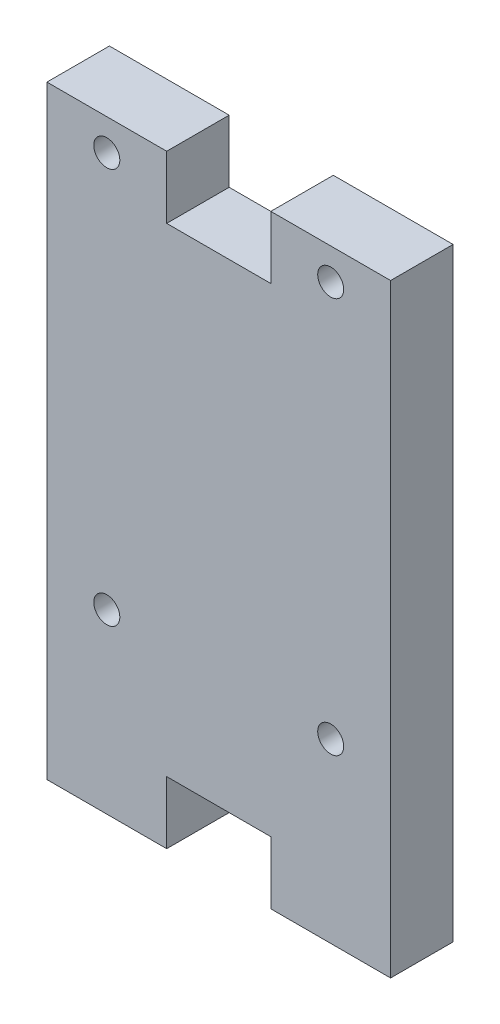
ISO-10303-21;
HEADER;
FILE_DESCRIPTION(('STEP AP214'),'2;1');
FILE_NAME('part.step','',(''),(''),'','','');
FILE_SCHEMA(('AUTOMOTIVE_DESIGN { 1 0 10303 214 1 1 1 1 }'));
ENDSEC;
DATA;
#1=APPLICATION_CONTEXT('core data for automotive mechanical design processes');
#2=APPLICATION_PROTOCOL_DEFINITION('international standard','automotive_design',2000,#1);
#3=PRODUCT_CONTEXT('',#1,'mechanical');
#4=PRODUCT('Part','Part','',(#3));
#5=PRODUCT_RELATED_PRODUCT_CATEGORY('part','',(#4));
#6=PRODUCT_DEFINITION_FORMATION('','',#4);
#7=PRODUCT_DEFINITION_CONTEXT('part definition',#1,'design');
#8=PRODUCT_DEFINITION('design','',#6,#7);
#9=PRODUCT_DEFINITION_SHAPE('','',#8);
#10=(LENGTH_UNIT() NAMED_UNIT(*) SI_UNIT(.MILLI.,.METRE.));
#11=(NAMED_UNIT(*) PLANE_ANGLE_UNIT() SI_UNIT($,.RADIAN.));
#12=(NAMED_UNIT(*) SI_UNIT($,.STERADIAN.) SOLID_ANGLE_UNIT());
#13=UNCERTAINTY_MEASURE_WITH_UNIT(LENGTH_MEASURE(1.E-05),#10,'distance_accuracy_value','');
#14=(GEOMETRIC_REPRESENTATION_CONTEXT(3) GLOBAL_UNCERTAINTY_ASSIGNED_CONTEXT((#13)) GLOBAL_UNIT_ASSIGNED_CONTEXT((#10,
#11,#12)) REPRESENTATION_CONTEXT('',''));
#15=CARTESIAN_POINT('',(0.,0.,0.));
#16=DIRECTION('',(0.,0.,1.));
#17=DIRECTION('',(1.,0.,0.));
#18=AXIS2_PLACEMENT_3D('',#15,#16,#17);
#19=CARTESIAN_POINT('',(-16.5,22.,6.));
#20=DIRECTION('',(1.,0.,0.));
#21=DIRECTION('',(0.,1.,0.));
#22=AXIS2_PLACEMENT_3D('',#19,#20,#21);
#23=PLANE('',#22);
#24=DIRECTION('',(0.,-1.,0.));
#25=VECTOR('',#24,1.);
#26=CARTESIAN_POINT('',(-16.5,22.,0.));
#27=LINE('',#26,#25);
#28=CARTESIAN_POINT('',(-16.5,22.,0.));
#29=VERTEX_POINT('',#28);
#30=CARTESIAN_POINT('',(-16.5,-36.,0.));
#31=VERTEX_POINT('',#30);
#32=EDGE_CURVE('E153',#29,#31,#27,.T.);
#33=ORIENTED_EDGE('',*,*,#32,.T.);
#34=DIRECTION('',(0.,0.,-1.));
#35=VECTOR('',#34,1.);
#36=CARTESIAN_POINT('',(-16.5,-36.,6.));
#37=LINE('',#36,#35);
#38=CARTESIAN_POINT('',(-16.5,-36.,6.));
#39=VERTEX_POINT('',#38);
#40=EDGE_CURVE('E11',#39,#31,#37,.T.);
#41=ORIENTED_EDGE('',*,*,#40,.F.);
#42=DIRECTION('',(0.,-1.,0.));
#43=VECTOR('',#42,1.);
#44=CARTESIAN_POINT('',(-16.5,22.,6.));
#45=LINE('',#44,#43);
#46=CARTESIAN_POINT('',(-16.5,22.,6.));
#47=VERTEX_POINT('',#46);
#48=EDGE_CURVE('E176',#47,#39,#45,.T.);
#49=ORIENTED_EDGE('',*,*,#48,.F.);
#50=DIRECTION('',(0.,0.,-1.));
#51=VECTOR('',#50,1.);
#52=CARTESIAN_POINT('',(-16.5,22.,6.));
#53=LINE('',#52,#51);
#54=EDGE_CURVE('E149',#47,#29,#53,.T.);
#55=ORIENTED_EDGE('',*,*,#54,.T.);
#56=EDGE_LOOP('',(#33,#41,#49,#55));
#57=FACE_BOUND('',#56,.T.);
#58=ADVANCED_FACE('F33',(#57),#23,.F.);
#59=CARTESIAN_POINT('',(-16.5,-36.,6.));
#60=DIRECTION('',(0.,1.,0.));
#61=DIRECTION('',(-1.,0.,0.));
#62=AXIS2_PLACEMENT_3D('',#59,#60,#61);
#63=PLANE('',#62);
#64=DIRECTION('',(1.,0.,0.));
#65=VECTOR('',#64,1.);
#66=CARTESIAN_POINT('',(-16.5,-36.,0.));
#67=LINE('',#66,#65);
#68=CARTESIAN_POINT('',(-4.99999999999999,-36.,0.));
#69=VERTEX_POINT('',#68);
#70=EDGE_CURVE('E156',#31,#69,#67,.T.);
#71=ORIENTED_EDGE('',*,*,#70,.T.);
#72=DIRECTION('',(0.,0.,-1.));
#73=VECTOR('',#72,1.);
#74=CARTESIAN_POINT('',(-4.99999999999999,-36.,6.));
#75=LINE('',#74,#73);
#76=CARTESIAN_POINT('',(-4.99999999999999,-36.,6.));
#77=VERTEX_POINT('',#76);
#78=EDGE_CURVE('E41',#77,#69,#75,.T.);
#79=ORIENTED_EDGE('',*,*,#78,.F.);
#80=DIRECTION('',(1.,0.,0.));
#81=VECTOR('',#80,1.);
#82=CARTESIAN_POINT('',(-16.5,-36.,6.));
#83=LINE('',#82,#81);
#84=EDGE_CURVE('E104',#39,#77,#83,.T.);
#85=ORIENTED_EDGE('',*,*,#84,.F.);
#86=ORIENTED_EDGE('',*,*,#40,.T.);
#87=EDGE_LOOP('',(#71,#79,#85,#86));
#88=FACE_BOUND('',#87,.T.);
#89=ADVANCED_FACE('F255',(#88),#63,.F.);
#90=CARTESIAN_POINT('',(-4.99999999999999,-36.,6.));
#91=DIRECTION('',(-1.,0.,0.));
#92=DIRECTION('',(0.,0.,1.));
#93=AXIS2_PLACEMENT_3D('',#90,#91,#92);
#94=PLANE('',#93);
#95=DIRECTION('',(0.,1.,0.));
#96=VECTOR('',#95,1.);
#97=CARTESIAN_POINT('',(-4.99999999999999,-36.,0.));
#98=LINE('',#97,#96);
#99=CARTESIAN_POINT('',(-4.99999999999999,-30.,0.));
#100=VERTEX_POINT('',#99);
#101=EDGE_CURVE('E159',#69,#100,#98,.T.);
#102=ORIENTED_EDGE('',*,*,#101,.T.);
#103=DIRECTION('',(0.,0.,-1.));
#104=VECTOR('',#103,1.);
#105=CARTESIAN_POINT('',(-4.99999999999999,-30.,6.));
#106=LINE('',#105,#104);
#107=CARTESIAN_POINT('',(-4.99999999999999,-30.,6.));
#108=VERTEX_POINT('',#107);
#109=EDGE_CURVE('E195',#108,#100,#106,.T.);
#110=ORIENTED_EDGE('',*,*,#109,.F.);
#111=DIRECTION('',(0.,1.,0.));
#112=VECTOR('',#111,1.);
#113=CARTESIAN_POINT('',(-4.99999999999999,-36.,6.));
#114=LINE('',#113,#112);
#115=EDGE_CURVE('E203',#77,#108,#114,.T.);
#116=ORIENTED_EDGE('',*,*,#115,.F.);
#117=ORIENTED_EDGE('',*,*,#78,.T.);
#118=EDGE_LOOP('',(#102,#110,#116,#117));
#119=FACE_BOUND('',#118,.T.);
#120=ADVANCED_FACE('F201',(#119),#94,.F.);
#121=CARTESIAN_POINT('',(-4.99999999999999,-30.,6.));
#122=DIRECTION('',(0.,1.,0.));
#123=DIRECTION('',(0.,0.,1.));
#124=AXIS2_PLACEMENT_3D('',#121,#122,#123);
#125=PLANE('',#124);
#126=DIRECTION('',(1.,0.,0.));
#127=VECTOR('',#126,1.);
#128=CARTESIAN_POINT('',(-4.99999999999999,-30.,0.));
#129=LINE('',#128,#127);
#130=CARTESIAN_POINT('',(5.00000000000001,-30.,0.));
#131=VERTEX_POINT('',#130);
#132=EDGE_CURVE('E161',#100,#131,#129,.T.);
#133=ORIENTED_EDGE('',*,*,#132,.T.);
#134=DIRECTION('',(0.,0.,-1.));
#135=VECTOR('',#134,1.);
#136=CARTESIAN_POINT('',(5.00000000000001,-30.,6.));
#137=LINE('',#136,#135);
#138=CARTESIAN_POINT('',(5.00000000000001,-30.,6.));
#139=VERTEX_POINT('',#138);
#140=EDGE_CURVE('E192',#139,#131,#137,.T.);
#141=ORIENTED_EDGE('',*,*,#140,.F.);
#142=DIRECTION('',(1.,0.,0.));
#143=VECTOR('',#142,1.);
#144=CARTESIAN_POINT('',(-4.99999999999999,-30.,6.));
#145=LINE('',#144,#143);
#146=EDGE_CURVE('E221',#108,#139,#145,.T.);
#147=ORIENTED_EDGE('',*,*,#146,.F.);
#148=ORIENTED_EDGE('',*,*,#109,.T.);
#149=EDGE_LOOP('',(#133,#141,#147,#148));
#150=FACE_BOUND('',#149,.T.);
#151=ADVANCED_FACE('F212',(#150),#125,.F.);
#152=CARTESIAN_POINT('',(5.00000000000001,-30.,6.));
#153=DIRECTION('',(1.,0.,0.));
#154=DIRECTION('',(0.,0.,-1.));
#155=AXIS2_PLACEMENT_3D('',#152,#153,#154);
#156=PLANE('',#155);
#157=DIRECTION('',(0.,-1.,0.));
#158=VECTOR('',#157,1.);
#159=CARTESIAN_POINT('',(5.00000000000001,-30.,0.));
#160=LINE('',#159,#158);
#161=CARTESIAN_POINT('',(5.00000000000001,-36.,0.));
#162=VERTEX_POINT('',#161);
#163=EDGE_CURVE('E163',#131,#162,#160,.T.);
#164=ORIENTED_EDGE('',*,*,#163,.T.);
#165=DIRECTION('',(0.,0.,-1.));
#166=VECTOR('',#165,1.);
#167=CARTESIAN_POINT('',(5.00000000000001,-36.,6.));
#168=LINE('',#167,#166);
#169=CARTESIAN_POINT('',(5.00000000000001,-36.,6.));
#170=VERTEX_POINT('',#169);
#171=EDGE_CURVE('E189',#170,#162,#168,.T.);
#172=ORIENTED_EDGE('',*,*,#171,.F.);
#173=DIRECTION('',(0.,-1.,0.));
#174=VECTOR('',#173,1.);
#175=CARTESIAN_POINT('',(5.00000000000001,-30.,6.));
#176=LINE('',#175,#174);
#177=EDGE_CURVE('E218',#139,#170,#176,.T.);
#178=ORIENTED_EDGE('',*,*,#177,.F.);
#179=ORIENTED_EDGE('',*,*,#140,.T.);
#180=EDGE_LOOP('',(#164,#172,#178,#179));
#181=FACE_BOUND('',#180,.T.);
#182=ADVANCED_FACE('F216',(#181),#156,.F.);
#183=CARTESIAN_POINT('',(5.00000000000001,-36.,6.));
#184=DIRECTION('',(0.,1.,0.));
#185=DIRECTION('',(0.,0.,1.));
#186=AXIS2_PLACEMENT_3D('',#183,#184,#185);
#187=PLANE('',#186);
#188=DIRECTION('',(1.,0.,0.));
#189=VECTOR('',#188,1.);
#190=CARTESIAN_POINT('',(5.00000000000001,-36.,0.));
#191=LINE('',#190,#189);
#192=CARTESIAN_POINT('',(16.5,-36.,0.));
#193=VERTEX_POINT('',#192);
#194=EDGE_CURVE('E165',#162,#193,#191,.T.);
#195=ORIENTED_EDGE('',*,*,#194,.T.);
#196=DIRECTION('',(0.,0.,-1.));
#197=VECTOR('',#196,1.);
#198=CARTESIAN_POINT('',(16.5,-36.,6.));
#199=LINE('',#198,#197);
#200=CARTESIAN_POINT('',(16.5,-36.,6.));
#201=VERTEX_POINT('',#200);
#202=EDGE_CURVE('E186',#201,#193,#199,.T.);
#203=ORIENTED_EDGE('',*,*,#202,.F.);
#204=DIRECTION('',(1.,0.,0.));
#205=VECTOR('',#204,1.);
#206=CARTESIAN_POINT('',(5.00000000000001,-36.,6.));
#207=LINE('',#206,#205);
#208=EDGE_CURVE('E220',#170,#201,#207,.T.);
#209=ORIENTED_EDGE('',*,*,#208,.F.);
#210=ORIENTED_EDGE('',*,*,#171,.T.);
#211=EDGE_LOOP('',(#195,#203,#209,#210));
#212=FACE_BOUND('',#211,.T.);
#213=ADVANCED_FACE('F268',(#212),#187,.F.);
#214=CARTESIAN_POINT('',(16.5,22.,6.));
#215=DIRECTION('',(-1.,0.,0.));
#216=DIRECTION('',(0.,-1.,0.));
#217=AXIS2_PLACEMENT_3D('',#214,#215,#216);
#218=PLANE('',#217);
#219=DIRECTION('',(0.,1.,0.));
#220=VECTOR('',#219,1.);
#221=CARTESIAN_POINT('',(16.5,22.,0.));
#222=LINE('',#221,#220);
#223=CARTESIAN_POINT('',(16.5,22.,0.));
#224=VERTEX_POINT('',#223);
#225=EDGE_CURVE('E167',#193,#224,#222,.T.);
#226=ORIENTED_EDGE('',*,*,#225,.T.);
#227=DIRECTION('',(0.,0.,-1.));
#228=VECTOR('',#227,1.);
#229=CARTESIAN_POINT('',(16.5,22.,6.));
#230=LINE('',#229,#228);
#231=CARTESIAN_POINT('',(16.5,22.,6.));
#232=VERTEX_POINT('',#231);
#233=EDGE_CURVE('E183',#232,#224,#230,.T.);
#234=ORIENTED_EDGE('',*,*,#233,.F.);
#235=DIRECTION('',(0.,1.,0.));
#236=VECTOR('',#235,1.);
#237=CARTESIAN_POINT('',(16.5,22.,6.));
#238=LINE('',#237,#236);
#239=EDGE_CURVE('E223',#201,#232,#238,.T.);
#240=ORIENTED_EDGE('',*,*,#239,.F.);
#241=ORIENTED_EDGE('',*,*,#202,.T.);
#242=EDGE_LOOP('',(#226,#234,#240,#241));
#243=FACE_BOUND('',#242,.T.);
#244=ADVANCED_FACE('F271',(#243),#218,.F.);
#245=CARTESIAN_POINT('',(5.,22.,6.));
#246=DIRECTION('',(0.,-1.,0.));
#247=DIRECTION('',(0.,0.,-1.));
#248=AXIS2_PLACEMENT_3D('',#245,#246,#247);
#249=PLANE('',#248);
#250=DIRECTION('',(-1.,0.,0.));
#251=VECTOR('',#250,1.);
#252=CARTESIAN_POINT('',(5.,22.,0.));
#253=LINE('',#252,#251);
#254=CARTESIAN_POINT('',(5.,22.,0.));
#255=VERTEX_POINT('',#254);
#256=EDGE_CURVE('E169',#224,#255,#253,.T.);
#257=ORIENTED_EDGE('',*,*,#256,.T.);
#258=DIRECTION('',(0.,0.,-1.));
#259=VECTOR('',#258,1.);
#260=CARTESIAN_POINT('',(5.,22.,6.));
#261=LINE('',#260,#259);
#262=CARTESIAN_POINT('',(5.,22.,6.));
#263=VERTEX_POINT('',#262);
#264=EDGE_CURVE('E180',#263,#255,#261,.T.);
#265=ORIENTED_EDGE('',*,*,#264,.F.);
#266=DIRECTION('',(-1.,0.,0.));
#267=VECTOR('',#266,1.);
#268=CARTESIAN_POINT('',(5.,22.,6.));
#269=LINE('',#268,#267);
#270=EDGE_CURVE('E229',#232,#263,#269,.T.);
#271=ORIENTED_EDGE('',*,*,#270,.F.);
#272=ORIENTED_EDGE('',*,*,#233,.T.);
#273=EDGE_LOOP('',(#257,#265,#271,#272));
#274=FACE_BOUND('',#273,.T.);
#275=ADVANCED_FACE('F235',(#274),#249,.F.);
#276=CARTESIAN_POINT('',(5.,16.,6.));
#277=DIRECTION('',(1.,0.,0.));
#278=DIRECTION('',(0.,1.,0.));
#279=AXIS2_PLACEMENT_3D('',#276,#277,#278);
#280=PLANE('',#279);
#281=DIRECTION('',(0.,-1.,0.));
#282=VECTOR('',#281,1.);
#283=CARTESIAN_POINT('',(5.,16.,0.));
#284=LINE('',#283,#282);
#285=CARTESIAN_POINT('',(5.,16.,0.));
#286=VERTEX_POINT('',#285);
#287=EDGE_CURVE('E171',#255,#286,#284,.T.);
#288=ORIENTED_EDGE('',*,*,#287,.T.);
#289=DIRECTION('',(0.,0.,-1.));
#290=VECTOR('',#289,1.);
#291=CARTESIAN_POINT('',(5.,16.,6.));
#292=LINE('',#291,#290);
#293=CARTESIAN_POINT('',(5.,16.,6.));
#294=VERTEX_POINT('',#293);
#295=EDGE_CURVE('E144',#294,#286,#292,.T.);
#296=ORIENTED_EDGE('',*,*,#295,.F.);
#297=DIRECTION('',(0.,-1.,0.));
#298=VECTOR('',#297,1.);
#299=CARTESIAN_POINT('',(5.,16.,6.));
#300=LINE('',#299,#298);
#301=EDGE_CURVE('E135',#263,#294,#300,.T.);
#302=ORIENTED_EDGE('',*,*,#301,.F.);
#303=ORIENTED_EDGE('',*,*,#264,.T.);
#304=EDGE_LOOP('',(#288,#296,#302,#303));
#305=FACE_BOUND('',#304,.T.);
#306=ADVANCED_FACE('F239',(#305),#280,.F.);
#307=CARTESIAN_POINT('',(-5.,16.,6.));
#308=DIRECTION('',(0.,-1.,0.));
#309=DIRECTION('',(1.,0.,0.));
#310=AXIS2_PLACEMENT_3D('',#307,#308,#309);
#311=PLANE('',#310);
#312=DIRECTION('',(-1.,0.,0.));
#313=VECTOR('',#312,1.);
#314=CARTESIAN_POINT('',(-5.,16.,0.));
#315=LINE('',#314,#313);
#316=CARTESIAN_POINT('',(-5.,16.,0.));
#317=VERTEX_POINT('',#316);
#318=EDGE_CURVE('E143',#286,#317,#315,.T.);
#319=ORIENTED_EDGE('',*,*,#318,.T.);
#320=DIRECTION('',(0.,0.,-1.));
#321=VECTOR('',#320,1.);
#322=CARTESIAN_POINT('',(-5.,16.,6.));
#323=LINE('',#322,#321);
#324=CARTESIAN_POINT('',(-5.,16.,6.));
#325=VERTEX_POINT('',#324);
#326=EDGE_CURVE('E140',#325,#317,#323,.T.);
#327=ORIENTED_EDGE('',*,*,#326,.F.);
#328=DIRECTION('',(-1.,0.,0.));
#329=VECTOR('',#328,1.);
#330=CARTESIAN_POINT('',(-5.,16.,6.));
#331=LINE('',#330,#329);
#332=EDGE_CURVE('E129',#294,#325,#331,.T.);
#333=ORIENTED_EDGE('',*,*,#332,.F.);
#334=ORIENTED_EDGE('',*,*,#295,.T.);
#335=EDGE_LOOP('',(#319,#327,#333,#334));
#336=FACE_BOUND('',#335,.T.);
#337=ADVANCED_FACE('F141',(#336),#311,.F.);
#338=CARTESIAN_POINT('',(-5.,22.,6.));
#339=DIRECTION('',(-1.,0.,0.));
#340=DIRECTION('',(0.,-1.,0.));
#341=AXIS2_PLACEMENT_3D('',#338,#339,#340);
#342=PLANE('',#341);
#343=DIRECTION('',(0.,1.,0.));
#344=VECTOR('',#343,1.);
#345=CARTESIAN_POINT('',(-5.,22.,0.));
#346=LINE('',#345,#344);
#347=CARTESIAN_POINT('',(-5.,22.,0.));
#348=VERTEX_POINT('',#347);
#349=EDGE_CURVE('E90',#317,#348,#346,.T.);
#350=ORIENTED_EDGE('',*,*,#349,.T.);
#351=DIRECTION('',(0.,0.,-1.));
#352=VECTOR('',#351,1.);
#353=CARTESIAN_POINT('',(-5.,22.,6.));
#354=LINE('',#353,#352);
#355=CARTESIAN_POINT('',(-5.,22.,6.));
#356=VERTEX_POINT('',#355);
#357=EDGE_CURVE('E145',#356,#348,#354,.T.);
#358=ORIENTED_EDGE('',*,*,#357,.F.);
#359=DIRECTION('',(0.,1.,0.));
#360=VECTOR('',#359,1.);
#361=CARTESIAN_POINT('',(-5.,22.,6.));
#362=LINE('',#361,#360);
#363=EDGE_CURVE('E133',#325,#356,#362,.T.);
#364=ORIENTED_EDGE('',*,*,#363,.F.);
#365=ORIENTED_EDGE('',*,*,#326,.T.);
#366=EDGE_LOOP('',(#350,#358,#364,#365));
#367=FACE_BOUND('',#366,.T.);
#368=ADVANCED_FACE('F147',(#367),#342,.F.);
#369=CARTESIAN_POINT('',(-16.5,22.,6.));
#370=DIRECTION('',(0.,-1.,0.));
#371=DIRECTION('',(0.,0.,-1.));
#372=AXIS2_PLACEMENT_3D('',#369,#370,#371);
#373=PLANE('',#372);
#374=DIRECTION('',(-1.,0.,0.));
#375=VECTOR('',#374,1.);
#376=CARTESIAN_POINT('',(-16.5,22.,0.));
#377=LINE('',#376,#375);
#378=EDGE_CURVE('E96',#348,#29,#377,.T.);
#379=ORIENTED_EDGE('',*,*,#378,.T.);
#380=ORIENTED_EDGE('',*,*,#54,.F.);
#381=DIRECTION('',(-1.,0.,0.));
#382=VECTOR('',#381,1.);
#383=CARTESIAN_POINT('',(-16.5,22.,6.));
#384=LINE('',#383,#382);
#385=EDGE_CURVE('E49',#356,#47,#384,.T.);
#386=ORIENTED_EDGE('',*,*,#385,.F.);
#387=ORIENTED_EDGE('',*,*,#357,.T.);
#388=EDGE_LOOP('',(#379,#380,#386,#387));
#389=FACE_BOUND('',#388,.T.);
#390=ADVANCED_FACE('F243',(#389),#373,.F.);
#391=CARTESIAN_POINT('',(0.,0.,6.));
#392=DIRECTION('',(0.,0.,1.));
#393=DIRECTION('',(1.,0.,0.));
#394=AXIS2_PLACEMENT_3D('',#391,#392,#393);
#395=PLANE('',#394);
#396=CARTESIAN_POINT('',(-10.75,-19.,6.));
#397=DIRECTION('',(0.,0.,1.));
#398=DIRECTION('',(-1.,0.,0.));
#399=AXIS2_PLACEMENT_3D('',#396,#397,#398);
#400=CIRCLE('',#399,1.25);
#401=CARTESIAN_POINT('',(-12.,-19.,6.));
#402=VERTEX_POINT('',#401);
#403=EDGE_CURVE('E361',#402,#402,#400,.T.);
#404=ORIENTED_EDGE('',*,*,#403,.F.);
#405=EDGE_LOOP('',(#404));
#406=FACE_BOUND('',#405,.T.);
#407=CARTESIAN_POINT('',(10.75,-19.,6.));
#408=DIRECTION('',(0.,0.,1.));
#409=DIRECTION('',(-1.,0.,0.));
#410=AXIS2_PLACEMENT_3D('',#407,#408,#409);
#411=CIRCLE('',#410,1.25);
#412=CARTESIAN_POINT('',(9.50000000000001,-19.,6.));
#413=VERTEX_POINT('',#412);
#414=EDGE_CURVE('E363',#413,#413,#411,.T.);
#415=ORIENTED_EDGE('',*,*,#414,.F.);
#416=EDGE_LOOP('',(#415));
#417=FACE_BOUND('',#416,.T.);
#418=CARTESIAN_POINT('',(10.75,19.,6.));
#419=DIRECTION('',(0.,0.,1.));
#420=DIRECTION('',(1.,0.,0.));
#421=AXIS2_PLACEMENT_3D('',#418,#419,#420);
#422=CIRCLE('',#421,1.25);
#423=CARTESIAN_POINT('',(12.,19.,6.));
#424=VERTEX_POINT('',#423);
#425=EDGE_CURVE('E369',#424,#424,#422,.T.);
#426=ORIENTED_EDGE('',*,*,#425,.F.);
#427=EDGE_LOOP('',(#426));
#428=FACE_BOUND('',#427,.T.);
#429=CARTESIAN_POINT('',(-10.75,19.,6.));
#430=DIRECTION('',(0.,0.,1.));
#431=DIRECTION('',(1.,0.,0.));
#432=AXIS2_PLACEMENT_3D('',#429,#430,#431);
#433=CIRCLE('',#432,1.25);
#434=CARTESIAN_POINT('',(-9.5,19.,6.));
#435=VERTEX_POINT('',#434);
#436=EDGE_CURVE('E375',#435,#435,#433,.T.);
#437=ORIENTED_EDGE('',*,*,#436,.F.);
#438=EDGE_LOOP('',(#437));
#439=FACE_BOUND('',#438,.T.);
#440=ORIENTED_EDGE('',*,*,#48,.T.);
#441=ORIENTED_EDGE('',*,*,#84,.T.);
#442=ORIENTED_EDGE('',*,*,#115,.T.);
#443=ORIENTED_EDGE('',*,*,#146,.T.);
#444=ORIENTED_EDGE('',*,*,#177,.T.);
#445=ORIENTED_EDGE('',*,*,#208,.T.);
#446=ORIENTED_EDGE('',*,*,#239,.T.);
#447=ORIENTED_EDGE('',*,*,#270,.T.);
#448=ORIENTED_EDGE('',*,*,#301,.T.);
#449=ORIENTED_EDGE('',*,*,#332,.T.);
#450=ORIENTED_EDGE('',*,*,#363,.T.);
#451=ORIENTED_EDGE('',*,*,#385,.T.);
#452=EDGE_LOOP('',(#440,#441,#442,#443,#444,#445,#446,#447,#448,#449,#450,#451));
#453=FACE_BOUND('',#452,.T.);
#454=ADVANCED_FACE('F131',(#406,#417,#428,#439,#453),#395,.T.);
#455=CARTESIAN_POINT('',(0.,0.,0.));
#456=DIRECTION('',(0.,0.,1.));
#457=DIRECTION('',(1.,0.,0.));
#458=AXIS2_PLACEMENT_3D('',#455,#456,#457);
#459=PLANE('',#458);
#460=CARTESIAN_POINT('',(-10.75,-19.,0.));
#461=DIRECTION('',(0.,0.,1.));
#462=DIRECTION('',(-1.,0.,0.));
#463=AXIS2_PLACEMENT_3D('',#460,#461,#462);
#464=CIRCLE('',#463,1.25);
#465=CARTESIAN_POINT('',(-12.,-19.,0.));
#466=VERTEX_POINT('',#465);
#467=EDGE_CURVE('E358',#466,#466,#464,.T.);
#468=ORIENTED_EDGE('',*,*,#467,.T.);
#469=EDGE_LOOP('',(#468));
#470=FACE_BOUND('',#469,.T.);
#471=CARTESIAN_POINT('',(10.75,-19.,0.));
#472=DIRECTION('',(0.,0.,1.));
#473=DIRECTION('',(-1.,0.,0.));
#474=AXIS2_PLACEMENT_3D('',#471,#472,#473);
#475=CIRCLE('',#474,1.25);
#476=CARTESIAN_POINT('',(9.50000000000001,-19.,0.));
#477=VERTEX_POINT('',#476);
#478=EDGE_CURVE('E366',#477,#477,#475,.T.);
#479=ORIENTED_EDGE('',*,*,#478,.T.);
#480=EDGE_LOOP('',(#479));
#481=FACE_BOUND('',#480,.T.);
#482=CARTESIAN_POINT('',(10.75,19.,0.));
#483=DIRECTION('',(0.,0.,1.));
#484=DIRECTION('',(1.,0.,0.));
#485=AXIS2_PLACEMENT_3D('',#482,#483,#484);
#486=CIRCLE('',#485,1.25);
#487=CARTESIAN_POINT('',(12.,19.,0.));
#488=VERTEX_POINT('',#487);
#489=EDGE_CURVE('E372',#488,#488,#486,.T.);
#490=ORIENTED_EDGE('',*,*,#489,.T.);
#491=EDGE_LOOP('',(#490));
#492=FACE_BOUND('',#491,.T.);
#493=CARTESIAN_POINT('',(-10.75,19.,0.));
#494=DIRECTION('',(0.,0.,1.));
#495=DIRECTION('',(1.,0.,0.));
#496=AXIS2_PLACEMENT_3D('',#493,#494,#495);
#497=CIRCLE('',#496,1.25);
#498=CARTESIAN_POINT('',(-9.5,19.,0.));
#499=VERTEX_POINT('',#498);
#500=EDGE_CURVE('E157',#499,#499,#497,.T.);
#501=ORIENTED_EDGE('',*,*,#500,.T.);
#502=EDGE_LOOP('',(#501));
#503=FACE_BOUND('',#502,.T.);
#504=ORIENTED_EDGE('',*,*,#32,.F.);
#505=ORIENTED_EDGE('',*,*,#378,.F.);
#506=ORIENTED_EDGE('',*,*,#349,.F.);
#507=ORIENTED_EDGE('',*,*,#318,.F.);
#508=ORIENTED_EDGE('',*,*,#287,.F.);
#509=ORIENTED_EDGE('',*,*,#256,.F.);
#510=ORIENTED_EDGE('',*,*,#225,.F.);
#511=ORIENTED_EDGE('',*,*,#194,.F.);
#512=ORIENTED_EDGE('',*,*,#163,.F.);
#513=ORIENTED_EDGE('',*,*,#132,.F.);
#514=ORIENTED_EDGE('',*,*,#101,.F.);
#515=ORIENTED_EDGE('',*,*,#70,.F.);
#516=EDGE_LOOP('',(#504,#505,#506,#507,#508,#509,#510,#511,#512,#513,#514,#515));
#517=FACE_BOUND('',#516,.T.);
#518=ADVANCED_FACE('F207',(#470,#481,#492,#503,#517),#459,.F.);
#519=CARTESIAN_POINT('',(-10.75,19.,0.));
#520=DIRECTION('',(0.,0.,1.));
#521=DIRECTION('',(1.,0.,0.));
#522=AXIS2_PLACEMENT_3D('',#519,#520,#521);
#523=CYLINDRICAL_SURFACE('',#522,1.25);
#524=ORIENTED_EDGE('',*,*,#500,.F.);
#525=EDGE_LOOP('',(#524));
#526=FACE_BOUND('',#525,.T.);
#527=ORIENTED_EDGE('',*,*,#436,.T.);
#528=EDGE_LOOP('',(#527));
#529=FACE_BOUND('',#528,.T.);
#530=ADVANCED_FACE('F311',(#526,#529),#523,.F.);
#531=CARTESIAN_POINT('',(10.75,19.,0.));
#532=DIRECTION('',(0.,0.,1.));
#533=DIRECTION('',(1.,0.,0.));
#534=AXIS2_PLACEMENT_3D('',#531,#532,#533);
#535=CYLINDRICAL_SURFACE('',#534,1.25);
#536=ORIENTED_EDGE('',*,*,#489,.F.);
#537=EDGE_LOOP('',(#536));
#538=FACE_BOUND('',#537,.T.);
#539=ORIENTED_EDGE('',*,*,#425,.T.);
#540=EDGE_LOOP('',(#539));
#541=FACE_BOUND('',#540,.T.);
#542=ADVANCED_FACE('F321',(#538,#541),#535,.F.);
#543=CARTESIAN_POINT('',(10.75,-19.,0.));
#544=DIRECTION('',(0.,0.,1.));
#545=DIRECTION('',(1.,0.,0.));
#546=AXIS2_PLACEMENT_3D('',#543,#544,#545);
#547=CYLINDRICAL_SURFACE('',#546,1.25);
#548=ORIENTED_EDGE('',*,*,#478,.F.);
#549=EDGE_LOOP('',(#548));
#550=FACE_BOUND('',#549,.T.);
#551=ORIENTED_EDGE('',*,*,#414,.T.);
#552=EDGE_LOOP('',(#551));
#553=FACE_BOUND('',#552,.T.);
#554=ADVANCED_FACE('F331',(#550,#553),#547,.F.);
#555=CARTESIAN_POINT('',(-10.75,-19.,0.));
#556=DIRECTION('',(0.,0.,1.));
#557=DIRECTION('',(1.,0.,0.));
#558=AXIS2_PLACEMENT_3D('',#555,#556,#557);
#559=CYLINDRICAL_SURFACE('',#558,1.25);
#560=ORIENTED_EDGE('',*,*,#467,.F.);
#561=EDGE_LOOP('',(#560));
#562=FACE_BOUND('',#561,.T.);
#563=ORIENTED_EDGE('',*,*,#403,.T.);
#564=EDGE_LOOP('',(#563));
#565=FACE_BOUND('',#564,.T.);
#566=ADVANCED_FACE('F341',(#562,#565),#559,.F.);
#567=CLOSED_SHELL('',(#58,#89,#120,#151,#182,#213,#244,#275,#306,#337,#368,#390,#454,#518,#530,
#542,#554,#566));
#568=MANIFOLD_SOLID_BREP('B2',#567);
#569=ADVANCED_BREP_SHAPE_REPRESENTATION('',(#18,#568),#14);
#570=SHAPE_DEFINITION_REPRESENTATION(#9,#569);
ENDSEC;
END-ISO-10303-21;
